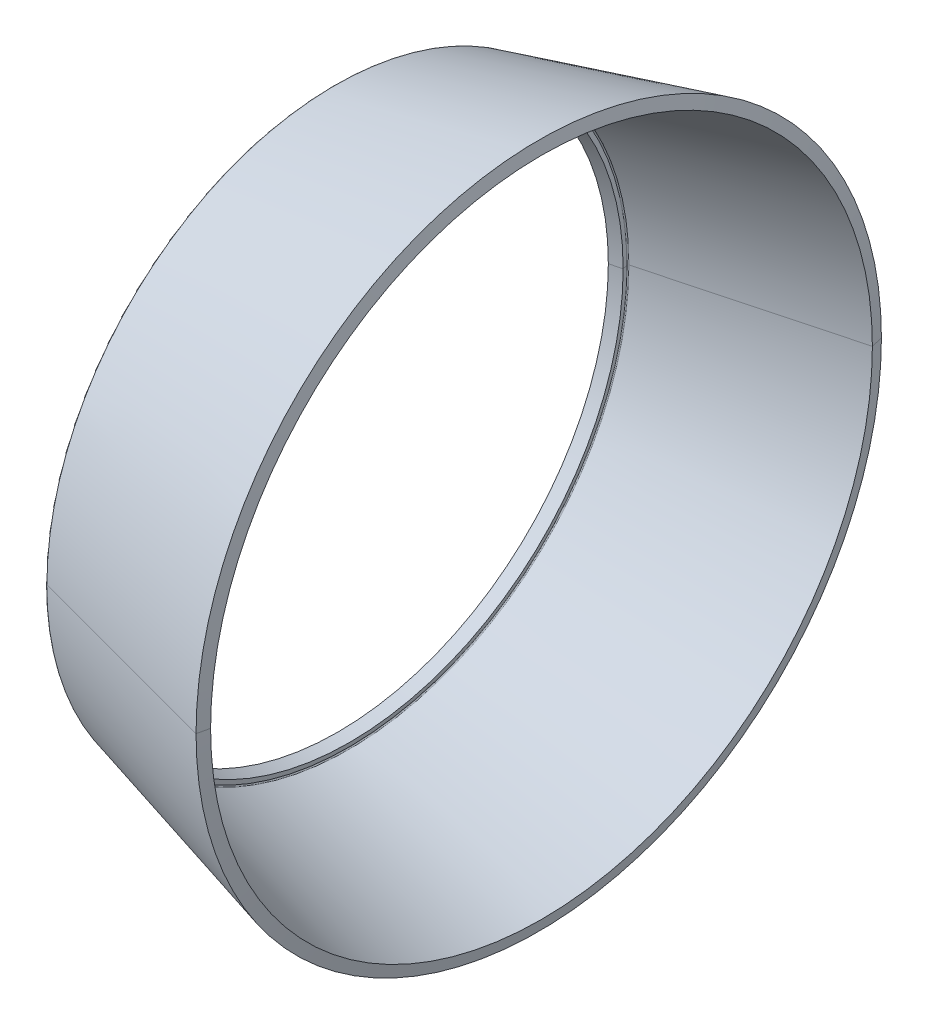
ISO-10303-21;
HEADER;
FILE_DESCRIPTION(('STEP AP214'),'2;1');
FILE_NAME('part.step','',(''),(''),'','','');
FILE_SCHEMA(('AUTOMOTIVE_DESIGN { 1 0 10303 214 1 1 1 1 }'));
ENDSEC;
DATA;
#1=APPLICATION_CONTEXT('core data for automotive mechanical design processes');
#2=APPLICATION_PROTOCOL_DEFINITION('international standard','automotive_design',2000,#1);
#3=PRODUCT_CONTEXT('',#1,'mechanical');
#4=PRODUCT('Part','Part','',(#3));
#5=PRODUCT_RELATED_PRODUCT_CATEGORY('part','',(#4));
#6=PRODUCT_DEFINITION_FORMATION('','',#4);
#7=PRODUCT_DEFINITION_CONTEXT('part definition',#1,'design');
#8=PRODUCT_DEFINITION('design','',#6,#7);
#9=PRODUCT_DEFINITION_SHAPE('','',#8);
#10=(LENGTH_UNIT() NAMED_UNIT(*) SI_UNIT(.MILLI.,.METRE.));
#11=(NAMED_UNIT(*) PLANE_ANGLE_UNIT() SI_UNIT($,.RADIAN.));
#12=(NAMED_UNIT(*) SI_UNIT($,.STERADIAN.) SOLID_ANGLE_UNIT());
#13=UNCERTAINTY_MEASURE_WITH_UNIT(LENGTH_MEASURE(1.E-05),#10,'distance_accuracy_value','');
#14=(GEOMETRIC_REPRESENTATION_CONTEXT(3) GLOBAL_UNCERTAINTY_ASSIGNED_CONTEXT((#13)) GLOBAL_UNIT_ASSIGNED_CONTEXT((#10,
#11,#12)) REPRESENTATION_CONTEXT('',''));
#15=CARTESIAN_POINT('',(0.,0.,0.));
#16=DIRECTION('',(0.,0.,1.));
#17=DIRECTION('',(1.,0.,0.));
#18=AXIS2_PLACEMENT_3D('',#15,#16,#17);
#19=CARTESIAN_POINT('',(15.054446933231,0.,0.));
#20=DIRECTION('',(1.,0.,0.));
#21=DIRECTION('',(0.,1.,0.));
#22=AXIS2_PLACEMENT_3D('',#19,#20,#21);
#23=CONICAL_SURFACE('',#22,28.295849956744,0.260638743846578);
#24=DIRECTION('',(0.966225572384578,0.,0.257697775058488));
#25=VECTOR('',#24,1.);
#26=CARTESIAN_POINT('',(-1.7409368670992,0.,23.816426972816));
#27=LINE('',#26,#25);
#28=CARTESIAN_POINT('',(-1.7409368670992,0.,23.816426972816));
#29=VERTEX_POINT('',#28);
#30=CARTESIAN_POINT('',(15.054446933231,0.,28.295849956744));
#31=VERTEX_POINT('',#30);
#32=EDGE_CURVE('E11',#29,#31,#27,.T.);
#33=ORIENTED_EDGE('',*,*,#32,.F.);
#34=CARTESIAN_POINT('',(-1.7409368670992,0.,0.));
#35=DIRECTION('',(1.,0.,0.));
#36=DIRECTION('',(0.,0.,-1.));
#37=AXIS2_PLACEMENT_3D('',#34,#35,#36);
#38=CIRCLE('',#37,23.816426972816);
#39=CARTESIAN_POINT('',(-1.74093686709921,-22.6507680673643,-7.35968067989002));
#40=VERTEX_POINT('',#39);
#41=EDGE_CURVE('E25',#29,#40,#38,.T.);
#42=ORIENTED_EDGE('',*,*,#41,.T.);
#43=CARTESIAN_POINT('',(-1.7409368670992,0.,0.));
#44=DIRECTION('',(1.,0.,0.));
#45=DIRECTION('',(0.,0.,-1.));
#46=AXIS2_PLACEMENT_3D('',#43,#44,#45);
#47=CIRCLE('',#46,23.816426972816);
#48=CARTESIAN_POINT('',(-1.7409368670992,0.,-23.816426972816));
#49=VERTEX_POINT('',#48);
#50=EDGE_CURVE('E385',#40,#49,#47,.T.);
#51=ORIENTED_EDGE('',*,*,#50,.T.);
#52=DIRECTION('',(0.966225572384578,0.,-0.257697775058488));
#53=VECTOR('',#52,1.);
#54=CARTESIAN_POINT('',(-1.7409368670992,0.,-23.816426972816));
#55=LINE('',#54,#53);
#56=CARTESIAN_POINT('',(15.054446933231,0.,-28.295849956744));
#57=VERTEX_POINT('',#56);
#58=EDGE_CURVE('E125',#49,#57,#55,.T.);
#59=ORIENTED_EDGE('',*,*,#58,.T.);
#60=CARTESIAN_POINT('',(15.054446933231,0.,0.));
#61=DIRECTION('',(1.,0.,0.));
#62=DIRECTION('',(0.,0.,-1.));
#63=AXIS2_PLACEMENT_3D('',#60,#61,#62);
#64=CIRCLE('',#63,28.295849956744);
#65=EDGE_CURVE('E377',#31,#57,#64,.T.);
#66=ORIENTED_EDGE('',*,*,#65,.F.);
#67=EDGE_LOOP('',(#33,#42,#51,#59,#66));
#68=FACE_BOUND('',#67,.T.);
#69=ADVANCED_FACE('F17',(#68),#23,.T.);
#70=CARTESIAN_POINT('',(15.282058371676,0.,0.));
#71=DIRECTION('',(-1.,0.,0.));
#72=DIRECTION('',(0.,1.,0.));
#73=AXIS2_PLACEMENT_3D('',#70,#71,#72);
#74=CONICAL_SURFACE('',#73,27.321600189775,1.34128553015771);
#75=DIRECTION('',(-0.227501175399713,0.,-0.973777805863201));
#76=VECTOR('',#75,1.);
#77=CARTESIAN_POINT('',(15.282058371676,0.,-27.321600189775));
#78=LINE('',#77,#76);
#79=CARTESIAN_POINT('',(15.282058371676,0.,-27.321600189775));
#80=VERTEX_POINT('',#79);
#81=EDGE_CURVE('E372',#80,#57,#78,.T.);
#82=ORIENTED_EDGE('',*,*,#81,.F.);
#83=CARTESIAN_POINT('',(15.282058371676,0.,0.));
#84=DIRECTION('',(1.,0.,0.));
#85=DIRECTION('',(0.,0.,-1.));
#86=AXIS2_PLACEMENT_3D('',#83,#84,#85);
#87=CIRCLE('',#86,27.321600189775);
#88=CARTESIAN_POINT('',(15.282058371676,0.,27.321600189775));
#89=VERTEX_POINT('',#88);
#90=EDGE_CURVE('E367',#89,#80,#87,.T.);
#91=ORIENTED_EDGE('',*,*,#90,.F.);
#92=DIRECTION('',(-0.227501175399713,0.,0.973777805863201));
#93=VECTOR('',#92,1.);
#94=CARTESIAN_POINT('',(15.282058371676,0.,27.321600189775));
#95=LINE('',#94,#93);
#96=EDGE_CURVE('E362',#89,#31,#95,.T.);
#97=ORIENTED_EDGE('',*,*,#96,.T.);
#98=ORIENTED_EDGE('',*,*,#65,.T.);
#99=EDGE_LOOP('',(#82,#91,#97,#98));
#100=FACE_BOUND('',#99,.T.);
#101=ADVANCED_FACE('F426',(#100),#74,.T.);
#102=CARTESIAN_POINT('',(15.282058371676,0.,0.));
#103=DIRECTION('',(-1.,0.,0.));
#104=DIRECTION('',(0.,-1.,0.));
#105=AXIS2_PLACEMENT_3D('',#102,#103,#104);
#106=CONICAL_SURFACE('',#105,27.321600189775,1.34128553015771);
#107=ORIENTED_EDGE('',*,*,#81,.T.);
#108=CARTESIAN_POINT('',(15.054446933231,0.,0.));
#109=DIRECTION('',(1.,0.,0.));
#110=DIRECTION('',(0.,0.,-1.));
#111=AXIS2_PLACEMENT_3D('',#108,#109,#110);
#112=CIRCLE('',#111,28.295849956744);
#113=EDGE_CURVE('E357',#57,#31,#112,.T.);
#114=ORIENTED_EDGE('',*,*,#113,.T.);
#115=ORIENTED_EDGE('',*,*,#96,.F.);
#116=CARTESIAN_POINT('',(15.282058371676,0.,0.));
#117=DIRECTION('',(1.,0.,0.));
#118=DIRECTION('',(0.,0.,-1.));
#119=AXIS2_PLACEMENT_3D('',#116,#117,#118);
#120=CIRCLE('',#119,27.321600189775);
#121=EDGE_CURVE('E352',#80,#89,#120,.T.);
#122=ORIENTED_EDGE('',*,*,#121,.F.);
#123=EDGE_LOOP('',(#107,#114,#115,#122));
#124=FACE_BOUND('',#123,.T.);
#125=ADVANCED_FACE('F430',(#124),#106,.T.);
#126=CARTESIAN_POINT('',(-0.587217882089972,0.,0.));
#127=DIRECTION('',(1.,0.,0.));
#128=DIRECTION('',(0.,-1.,0.));
#129=AXIS2_PLACEMENT_3D('',#126,#127,#128);
#130=CONICAL_SURFACE('',#129,23.089175278591,0.260638743846549);
#131=DIRECTION('',(0.966225572384585,0.,0.25769777505846));
#132=VECTOR('',#131,1.);
#133=CARTESIAN_POINT('',(-0.587217882089986,0.,23.089175278591));
#134=LINE('',#133,#132);
#135=CARTESIAN_POINT('',(-0.587217882089986,0.,23.089175278591));
#136=VERTEX_POINT('',#135);
#137=EDGE_CURVE('E340',#136,#89,#134,.T.);
#138=ORIENTED_EDGE('',*,*,#137,.F.);
#139=CARTESIAN_POINT('',(-0.587217882089972,0.,0.));
#140=DIRECTION('',(1.,0.,0.));
#141=DIRECTION('',(0.,0.,-1.));
#142=AXIS2_PLACEMENT_3D('',#139,#140,#141);
#143=CIRCLE('',#142,23.089175278591);
#144=CARTESIAN_POINT('',(-0.587217882089975,21.959110604585,7.13494754718653));
#145=VERTEX_POINT('',#144);
#146=EDGE_CURVE('E337',#145,#136,#143,.T.);
#147=ORIENTED_EDGE('',*,*,#146,.F.);
#148=CARTESIAN_POINT('',(-0.587217882089972,0.,0.));
#149=DIRECTION('',(1.,0.,0.));
#150=DIRECTION('',(0.,0.,-1.));
#151=AXIS2_PLACEMENT_3D('',#148,#149,#150);
#152=CIRCLE('',#151,23.089175278591);
#153=CARTESIAN_POINT('',(-0.587217882089972,0.,-23.089175278591));
#154=VERTEX_POINT('',#153);
#155=EDGE_CURVE('E330',#154,#145,#152,.T.);
#156=ORIENTED_EDGE('',*,*,#155,.F.);
#157=DIRECTION('',(0.966225572384585,0.,-0.25769777505846));
#158=VECTOR('',#157,1.);
#159=CARTESIAN_POINT('',(-0.587217882089986,0.,-23.089175278591));
#160=LINE('',#159,#158);
#161=EDGE_CURVE('E338',#154,#80,#160,.T.);
#162=ORIENTED_EDGE('',*,*,#161,.T.);
#163=ORIENTED_EDGE('',*,*,#121,.T.);
#164=EDGE_LOOP('',(#138,#147,#156,#162,#163));
#165=FACE_BOUND('',#164,.T.);
#166=ADVANCED_FACE('F435',(#165),#130,.F.);
#167=CARTESIAN_POINT('',(-0.587217882089972,0.,0.));
#168=DIRECTION('',(1.,0.,0.));
#169=DIRECTION('',(0.,1.,0.));
#170=AXIS2_PLACEMENT_3D('',#167,#168,#169);
#171=CONICAL_SURFACE('',#170,23.089175278591,0.260638743846549);
#172=ORIENTED_EDGE('',*,*,#137,.T.);
#173=ORIENTED_EDGE('',*,*,#90,.T.);
#174=ORIENTED_EDGE('',*,*,#161,.F.);
#175=CARTESIAN_POINT('',(-0.587217882089972,0.,0.));
#176=DIRECTION('',(1.,0.,0.));
#177=DIRECTION('',(0.,0.,-1.));
#178=AXIS2_PLACEMENT_3D('',#175,#176,#177);
#179=CIRCLE('',#178,23.089175278591);
#180=CARTESIAN_POINT('',(-0.587217882089975,-21.959110604585,-7.13494754718653));
#181=VERTEX_POINT('',#180);
#182=EDGE_CURVE('E333',#181,#154,#179,.T.);
#183=ORIENTED_EDGE('',*,*,#182,.F.);
#184=CARTESIAN_POINT('',(-0.587217882089972,0.,0.));
#185=DIRECTION('',(1.,0.,0.));
#186=DIRECTION('',(0.,0.,-1.));
#187=AXIS2_PLACEMENT_3D('',#184,#185,#186);
#188=CIRCLE('',#187,23.089175278591);
#189=EDGE_CURVE('E447',#136,#181,#188,.T.);
#190=ORIENTED_EDGE('',*,*,#189,.F.);
#191=EDGE_LOOP('',(#172,#173,#174,#183,#190));
#192=FACE_BOUND('',#191,.T.);
#193=ADVANCED_FACE('F301',(#192),#171,.F.);
#194=CARTESIAN_POINT('',(-0.564884074918387,0.,0.));
#195=DIRECTION('',(1.,0.,0.));
#196=DIRECTION('',(0.,0.309016994374947,-0.951056516295154));
#197=AXIS2_PLACEMENT_3D('',#194,#195,#196);
#198=TOROIDAL_SURFACE('',#197,23.0054357289845,0.0866666666664838);
#199=CARTESIAN_POINT('',(-0.564884074918387,-21.8794695602601,-7.10907060325681));
#200=DIRECTION('',(0.,0.309016994374945,-0.951056516295154));
#201=DIRECTION('',(-0.257697775057337,-0.91893512682766,-0.298580122266588));
#202=AXIS2_PLACEMENT_3D('',#199,#200,#201);
#203=CIRCLE('',#202,0.0866666666664824);
#204=CARTESIAN_POINT('',(-0.649278151426377,-21.860717799065,-7.1029777867055));
#205=VERTEX_POINT('',#204);
#206=EDGE_CURVE('E448',#181,#205,#203,.T.);
#207=ORIENTED_EDGE('',*,*,#206,.T.);
#208=CARTESIAN_POINT('',(-0.649278151426381,0.,0.));
#209=DIRECTION('',(1.,0.,0.));
#210=DIRECTION('',(0.,0.,1.));
#211=AXIS2_PLACEMENT_3D('',#208,#209,#210);
#212=CIRCLE('',#211,22.98571896045);
#213=CARTESIAN_POINT('',(-0.649278151426381,0.,22.98571896045));
#214=VERTEX_POINT('',#213);
#215=EDGE_CURVE('E267',#214,#205,#212,.T.);
#216=ORIENTED_EDGE('',*,*,#215,.F.);
#217=CARTESIAN_POINT('',(-0.649278151426381,0.,0.));
#218=DIRECTION('',(1.,0.,0.));
#219=DIRECTION('',(0.,0.951056516295156,0.309016994374939));
#220=AXIS2_PLACEMENT_3D('',#217,#218,#219);
#221=CIRCLE('',#220,22.98571896045);
#222=CARTESIAN_POINT('',(-0.649278151426377,21.860717799065,7.1029777867055));
#223=VERTEX_POINT('',#222);
#224=EDGE_CURVE('E242',#223,#214,#221,.T.);
#225=ORIENTED_EDGE('',*,*,#224,.F.);
#226=CARTESIAN_POINT('',(-0.564884074918387,21.8794695602601,7.10907060325682));
#227=DIRECTION('',(0.,-0.309016994374946,0.951056516295154));
#228=DIRECTION('',(-0.257697775057336,0.91893512682766,0.298580122266588));
#229=AXIS2_PLACEMENT_3D('',#226,#227,#228);
#230=CIRCLE('',#229,0.0866666666664823);
#231=EDGE_CURVE('E324',#145,#223,#230,.T.);
#232=ORIENTED_EDGE('',*,*,#231,.F.);
#233=ORIENTED_EDGE('',*,*,#146,.T.);
#234=ORIENTED_EDGE('',*,*,#189,.T.);
#235=EDGE_LOOP('',(#207,#216,#225,#232,#233,#234));
#236=FACE_BOUND('',#235,.T.);
#237=ADVANCED_FACE('F296',(#236),#198,.F.);
#238=CARTESIAN_POINT('',(-0.564884074918387,0.,0.));
#239=DIRECTION('',(1.,0.,0.));
#240=DIRECTION('',(0.,-0.309016994374947,0.951056516295154));
#241=AXIS2_PLACEMENT_3D('',#238,#239,#240);
#242=TOROIDAL_SURFACE('',#241,23.0054357289845,0.0866666666664838);
#243=ORIENTED_EDGE('',*,*,#206,.F.);
#244=ORIENTED_EDGE('',*,*,#182,.T.);
#245=ORIENTED_EDGE('',*,*,#155,.T.);
#246=ORIENTED_EDGE('',*,*,#231,.T.);
#247=CARTESIAN_POINT('',(-0.649278151426382,0.,0.));
#248=DIRECTION('',(1.,0.,0.));
#249=DIRECTION('',(0.,0.,-1.));
#250=AXIS2_PLACEMENT_3D('',#247,#248,#249);
#251=CIRCLE('',#250,22.98571896045);
#252=CARTESIAN_POINT('',(-0.649278151426382,0.,-22.98571896045));
#253=VERTEX_POINT('',#252);
#254=EDGE_CURVE('E326',#253,#223,#251,.T.);
#255=ORIENTED_EDGE('',*,*,#254,.F.);
#256=CARTESIAN_POINT('',(-0.649278151426381,0.,0.));
#257=DIRECTION('',(1.,0.,0.));
#258=DIRECTION('',(0.,-0.951056516295153,-0.30901699437495));
#259=AXIS2_PLACEMENT_3D('',#256,#257,#258);
#260=CIRCLE('',#259,22.98571896045);
#261=EDGE_CURVE('E256',#205,#253,#260,.T.);
#262=ORIENTED_EDGE('',*,*,#261,.F.);
#263=EDGE_LOOP('',(#243,#244,#245,#246,#255,#262));
#264=FACE_BOUND('',#263,.T.);
#265=ADVANCED_FACE('F287',(#264),#242,.F.);
#266=CARTESIAN_POINT('',(-0.554584816033737,0.,0.));
#267=DIRECTION('',(-1.,0.,0.));
#268=DIRECTION('',(0.,1.,0.));
#269=AXIS2_PLACEMENT_3D('',#266,#267,#268);
#270=CONICAL_SURFACE('',#269,22.580401193601,1.34128553015775);
#271=DIRECTION('',(-0.227501175399673,0.,-0.97377780586321));
#272=VECTOR('',#271,1.);
#273=CARTESIAN_POINT('',(-0.554584816033737,0.,-22.580401193601));
#274=LINE('',#273,#272);
#275=CARTESIAN_POINT('',(-0.554584816033737,0.,-22.580401193601));
#276=VERTEX_POINT('',#275);
#277=EDGE_CURVE('E276',#276,#253,#274,.T.);
#278=ORIENTED_EDGE('',*,*,#277,.F.);
#279=CARTESIAN_POINT('',(-0.554584816033737,0.,0.));
#280=DIRECTION('',(1.,0.,0.));
#281=DIRECTION('',(0.,0.,-1.));
#282=AXIS2_PLACEMENT_3D('',#279,#280,#281);
#283=CIRCLE('',#282,22.580401193601);
#284=CARTESIAN_POINT('',(-0.554584816033737,0.,22.580401193601));
#285=VERTEX_POINT('',#284);
#286=EDGE_CURVE('E270',#285,#276,#283,.T.);
#287=ORIENTED_EDGE('',*,*,#286,.F.);
#288=DIRECTION('',(-0.227501175399673,0.,0.97377780586321));
#289=VECTOR('',#288,1.);
#290=CARTESIAN_POINT('',(-0.554584816033737,0.,22.580401193601));
#291=LINE('',#290,#289);
#292=EDGE_CURVE('E268',#285,#214,#291,.T.);
#293=ORIENTED_EDGE('',*,*,#292,.T.);
#294=ORIENTED_EDGE('',*,*,#215,.T.);
#295=ORIENTED_EDGE('',*,*,#261,.T.);
#296=EDGE_LOOP('',(#278,#287,#293,#294,#295));
#297=FACE_BOUND('',#296,.T.);
#298=ADVANCED_FACE('F222',(#297),#270,.T.);
#299=CARTESIAN_POINT('',(-0.554584816033737,0.,0.));
#300=DIRECTION('',(-1.,0.,0.));
#301=DIRECTION('',(0.,-1.,0.));
#302=AXIS2_PLACEMENT_3D('',#299,#300,#301);
#303=CONICAL_SURFACE('',#302,22.580401193601,1.34128553015775);
#304=ORIENTED_EDGE('',*,*,#277,.T.);
#305=ORIENTED_EDGE('',*,*,#254,.T.);
#306=ORIENTED_EDGE('',*,*,#224,.T.);
#307=ORIENTED_EDGE('',*,*,#292,.F.);
#308=CARTESIAN_POINT('',(-0.554584816033737,0.,0.));
#309=DIRECTION('',(1.,0.,0.));
#310=DIRECTION('',(0.,0.,-1.));
#311=AXIS2_PLACEMENT_3D('',#308,#309,#310);
#312=CIRCLE('',#311,22.580401193601);
#313=EDGE_CURVE('E271',#276,#285,#312,.T.);
#314=ORIENTED_EDGE('',*,*,#313,.F.);
#315=EDGE_LOOP('',(#304,#305,#306,#307,#314));
#316=FACE_BOUND('',#315,.T.);
#317=ADVANCED_FACE('F217',(#316),#303,.T.);
#318=CARTESIAN_POINT('',(-1.5212786891811,0.,0.));
#319=DIRECTION('',(1.,0.,0.));
#320=DIRECTION('',(0.,-1.,0.));
#321=AXIS2_PLACEMENT_3D('',#318,#319,#320);
#322=CONICAL_SURFACE('',#321,22.322578520104,0.26063874384719);
#323=DIRECTION('',(0.96622557238442,0.,0.25769777505908));
#324=VECTOR('',#323,1.);
#325=CARTESIAN_POINT('',(-1.52127868918109,0.,22.322578520104));
#326=LINE('',#325,#324);
#327=CARTESIAN_POINT('',(-1.5212786891811,0.,22.322578520104));
#328=VERTEX_POINT('',#327);
#329=EDGE_CURVE('E413',#328,#285,#326,.T.);
#330=ORIENTED_EDGE('',*,*,#329,.F.);
#331=CARTESIAN_POINT('',(-1.5212786891811,0.,0.));
#332=DIRECTION('',(1.,0.,0.));
#333=DIRECTION('',(0.,0.,-1.));
#334=AXIS2_PLACEMENT_3D('',#331,#332,#333);
#335=CIRCLE('',#334,22.322578520104);
#336=CARTESIAN_POINT('',(-1.5212786891811,0.,-22.322578520104));
#337=VERTEX_POINT('',#336);
#338=EDGE_CURVE('E408',#337,#328,#335,.T.);
#339=ORIENTED_EDGE('',*,*,#338,.F.);
#340=DIRECTION('',(0.96622557238442,0.,-0.25769777505908));
#341=VECTOR('',#340,1.);
#342=CARTESIAN_POINT('',(-1.52127868918109,0.,-22.322578520104));
#343=LINE('',#342,#341);
#344=EDGE_CURVE('E399',#337,#276,#343,.T.);
#345=ORIENTED_EDGE('',*,*,#344,.T.);
#346=ORIENTED_EDGE('',*,*,#313,.T.);
#347=EDGE_LOOP('',(#330,#339,#345,#346));
#348=FACE_BOUND('',#347,.T.);
#349=ADVANCED_FACE('F213',(#348),#322,.F.);
#350=CARTESIAN_POINT('',(-1.5212786891811,0.,0.));
#351=DIRECTION('',(1.,0.,0.));
#352=DIRECTION('',(0.,1.,0.));
#353=AXIS2_PLACEMENT_3D('',#350,#351,#352);
#354=CONICAL_SURFACE('',#353,22.322578520104,0.26063874384719);
#355=ORIENTED_EDGE('',*,*,#329,.T.);
#356=ORIENTED_EDGE('',*,*,#286,.T.);
#357=ORIENTED_EDGE('',*,*,#344,.F.);
#358=CARTESIAN_POINT('',(-1.5212786891811,0.,0.));
#359=DIRECTION('',(1.,0.,0.));
#360=DIRECTION('',(0.,0.,-1.));
#361=AXIS2_PLACEMENT_3D('',#358,#359,#360);
#362=CIRCLE('',#361,22.322578520104);
#363=EDGE_CURVE('E398',#328,#337,#362,.T.);
#364=ORIENTED_EDGE('',*,*,#363,.F.);
#365=EDGE_LOOP('',(#355,#356,#357,#364));
#366=FACE_BOUND('',#365,.T.);
#367=ADVANCED_FACE('F209',(#366),#354,.F.);
#368=CARTESIAN_POINT('',(-1.8340272711038,0.,0.));
#369=DIRECTION('',(-1.,0.,0.));
#370=DIRECTION('',(0.,1.,0.));
#371=AXIS2_PLACEMENT_3D('',#368,#369,#370);
#372=CONICAL_SURFACE('',#371,23.661242495604,1.3412855301577);
#373=DIRECTION('',(-0.227501175399721,0.,-0.973777805863199));
#374=VECTOR('',#373,1.);
#375=CARTESIAN_POINT('',(-1.5212786891811,0.,-22.322578520104));
#376=LINE('',#375,#374);
#377=CARTESIAN_POINT('',(-1.8340272711038,0.,-23.661242495604));
#378=VERTEX_POINT('',#377);
#379=EDGE_CURVE('E397',#337,#378,#376,.T.);
#380=ORIENTED_EDGE('',*,*,#379,.T.);
#381=CARTESIAN_POINT('',(-1.8340272711038,-22.503178859084,-7.31172603916831));
#382=CARTESIAN_POINT('',(-1.8340272711038,-22.4074717500598,-7.60629312341181));
#383=CARTESIAN_POINT('',(-1.8340272711038,-22.3059746365077,-7.89897868033875));
#384=CARTESIAN_POINT('',(-1.8340272711038,-22.0915707765655,-8.48014055841196));
#385=CARTESIAN_POINT('',(-1.8340272711038,-21.9786640301753,-8.76861687955824));
#386=CARTESIAN_POINT('',(-1.8340272711038,-21.7416112807744,-9.34091410492264));
#387=CARTESIAN_POINT('',(-1.8340272711038,-21.6174652777636,-9.62473500914076));
#388=CARTESIAN_POINT('',(-1.8340272711038,-21.3581264354418,-10.1872841368972));
#389=CARTESIAN_POINT('',(-1.8340272711038,-21.2229335961308,-10.4660123604356));
#390=CARTESIAN_POINT('',(-1.8340272711038,-20.9417092718416,-11.0179462496401));
#391=CARTESIAN_POINT('',(-1.8340272711038,-20.7956777868635,-11.2911519153063));
#392=CARTESIAN_POINT('',(-1.8340272711038,-20.4930014127279,-11.8316194518187));
#393=CARTESIAN_POINT('',(-1.8340272711038,-20.3363565235705,-12.0988813226648));
#394=CARTESIAN_POINT('',(-1.8340272711038,-20.0126948569772,-12.6270491640334));
#395=CARTESIAN_POINT('',(-1.8340272711038,-19.8456780795413,-12.8879551345559));
#396=CARTESIAN_POINT('',(-1.8340272711038,-19.5015301692914,-13.4030088790761));
#397=CARTESIAN_POINT('',(-1.8340272711038,-19.3243990364774,-13.6571566530738));
#398=CARTESIAN_POINT('',(-1.8340272711038,-18.9602955374633,-14.1583021265901));
#399=CARTESIAN_POINT('',(-1.8340272711038,-18.7733231712632,-14.4052998261089));
#400=CARTESIAN_POINT('',(-1.8340272711038,-18.3898255036824,-14.8917642982534));
#401=CARTESIAN_POINT('',(-1.8340272711038,-18.1933002023016,-15.1312310708792));
#402=CARTESIAN_POINT('',(-1.8340272711038,-17.7909996920309,-15.6022644487951));
#403=CARTESIAN_POINT('',(-1.8340272711038,-17.585224483141,-15.8338310540852));
#404=CARTESIAN_POINT('',(-1.8340272711038,-17.1647414483355,-16.2887070384182));
#405=CARTESIAN_POINT('',(-1.8340272711038,-16.9500336224201,-16.5120164174611));
#406=CARTESIAN_POINT('',(-1.8340272711038,-16.5120164174618,-16.9500336224206));
#407=CARTESIAN_POINT('',(-1.8340272711038,-16.288707038419,-17.1647414483371));
#408=CARTESIAN_POINT('',(-1.8340272711038,-15.8338310540845,-17.5852244831392));
#409=CARTESIAN_POINT('',(-1.8340272711038,-15.602264448793,-17.7909996920248));
#410=CARTESIAN_POINT('',(-1.8340272711038,-15.1312310708816,-18.1933002023076));
#411=CARTESIAN_POINT('',(-1.8340272711038,-14.8917642982618,-18.3898255037048));
#412=CARTESIAN_POINT('',(-1.8340272711038,-14.4052998261006,-18.7733231712407));
#413=CARTESIAN_POINT('',(-1.8340272711038,-14.1583021265592,-18.9602955373793));
#414=CARTESIAN_POINT('',(-1.8340272711038,-13.6571566531048,-19.3243990365613));
#415=CARTESIAN_POINT('',(-1.8340272711038,-13.4030088791918,-19.5015301696047));
#416=CARTESIAN_POINT('',(-1.8340272711038,-12.8879551344404,-19.8456780792279));
#417=CARTESIAN_POINT('',(-1.8340272711038,-12.6270491636021,-20.0126948558078));
#418=CARTESIAN_POINT('',(-1.8340272711038,-12.0988813230963,-20.3363565247398));
#419=CARTESIAN_POINT('',(-1.8340272711038,-11.8316194534288,-20.493001417092));
#420=CARTESIAN_POINT('',(-1.8340272711038,-11.2911519136964,-20.7956777824993));
#421=CARTESIAN_POINT('',(-1.8340272711038,-11.0179462436313,-20.9417092555543));
#422=CARTESIAN_POINT('',(-1.8340272711038,-10.4660123664445,-21.2229336124181));
#423=CARTESIAN_POINT('',(-1.8340272711038,-10.1872841593227,-21.358126496227));
#424=CARTESIAN_POINT('',(-1.8340272711038,-9.62473498671542,-21.6174652169783));
#425=CARTESIAN_POINT('',(-1.8340272711038,-9.34091402122992,-21.7416110539208));
#426=CARTESIAN_POINT('',(-1.8340272711038,-8.76861696325113,-21.9786642570288));
#427=CARTESIAN_POINT('',(-1.8340272711038,-8.48014087075783,-22.0915716231943));
#428=CARTESIAN_POINT('',(-1.8340272711038,-7.89897836799305,-22.3059737898788));
#429=CARTESIAN_POINT('',(-1.8340272711038,-7.60629195772156,-22.4074685903977));
#430=CARTESIAN_POINT('',(-1.8340272711038,-7.01716012061524,-22.5988891277703));
#431=CARTESIAN_POINT('',(-1.8340272711038,-6.72071469378043,-22.6888148646239));
#432=CARTESIAN_POINT('',(-1.8340272711038,-6.12452192096644,-22.8569586171633));
#433=CARTESIAN_POINT('',(-1.8340272711038,-5.82477457498727,-22.9351766328489));
#434=CARTESIAN_POINT('',(-1.8340272711038,-5.22244015235107,-23.0797843310722));
#435=CARTESIAN_POINT('',(-1.8340272711038,-4.91985307569403,-23.1461740136098));
#436=CARTESIAN_POINT('',(-1.8340272711038,-4.31230575984431,-23.2670226978698));
#437=CARTESIAN_POINT('',(-1.8340272711038,-4.00734552065162,-23.3214816995921));
#438=CARTESIAN_POINT('',(-1.8340272711038,-3.39552210332252,-23.4183849742124));
#439=CARTESIAN_POINT('',(-1.8340272711038,-3.08865892518611,-23.4608292471103));
#440=CARTESIAN_POINT('',(-1.8340272711038,-2.47350280191822,-23.5336379023813));
#441=CARTESIAN_POINT('',(-1.8340272711038,-2.16520985678675,-23.5640022847544));
#442=CARTESIAN_POINT('',(-1.8340272711038,-1.54766952321811,-23.6126032783066));
#443=CARTESIAN_POINT('',(-1.8340272711038,-1.23842213478094,-23.6308398894857));
#444=CARTESIAN_POINT('',(-1.8340272711038,-0.619449907235353,-23.6551611807951));
#445=CARTESIAN_POINT('',(-1.8340272711038,-0.309725068126928,-23.6612458609254));
#446=CARTESIAN_POINT('',(-1.8340272711038,0.,-23.661242495604));
#447=B_SPLINE_CURVE_WITH_KNOTS('',3,(#381,#382,#383,#384,#385,#386,#387,#388,#389,#390,#391,
#392,#393,#394,#395,#396,#397,#398,#399,#400,#401,#402,#403,#404,#405,#406,#407,#408,#409,#410,
#411,#412,#413,#414,#415,#416,#417,#418,#419,#420,#421,#422,#423,#424,#425,#426,#427,#428,#429,
#430,#431,#432,#433,#434,#435,#436,#437,#438,#439,#440,#441,#442,#443,#444,#445,#446),
.UNSPECIFIED.,.F.,.F.,(4,2,2,2,2,2,2,2,2,2,2,2,2,2,2,2,2,2,2,2,2,2,2,2,2,2,2,2,2,2,2,2,4),(0.,
0.929115116790071,1.85823023358015,2.78734535037023,3.7164604671603,4.64557558395037,
5.57469070074044,6.50380581753052,7.43292093432059,8.36203605111067,9.29115116790075,
10.2202662846908,11.1493814014809,12.078496518271,13.007611635061,13.9367267518511,
14.8658418686412,15.7949569854313,16.7240721022213,17.6531872190114,18.5823023358015,
19.5114174525916,20.4405325693816,21.3696476861717,22.2987628029618,23.2278779197519,
24.1569930365419,25.086108153332,26.0152232701221,26.9443383869122,27.8734535037022,
28.8025686204923,29.7316837372824),.UNSPECIFIED.);
#448=CARTESIAN_POINT('',(-1.8340272711038,-22.503178859084,-7.31172603916832));
#449=VERTEX_POINT('',#448);
#450=EDGE_CURVE('E161',#449,#378,#447,.T.);
#451=ORIENTED_EDGE('',*,*,#450,.F.);
#452=CARTESIAN_POINT('',(-1.8340272711038,0.,0.));
#453=DIRECTION('',(1.,0.,0.));
#454=DIRECTION('',(0.,0.,-1.));
#455=AXIS2_PLACEMENT_3D('',#452,#453,#454);
#456=CIRCLE('',#455,23.661242495604);
#457=CARTESIAN_POINT('',(-1.8340272711038,0.,23.661242495604));
#458=VERTEX_POINT('',#457);
#459=EDGE_CURVE('E189',#458,#449,#456,.T.);
#460=ORIENTED_EDGE('',*,*,#459,.F.);
#461=DIRECTION('',(-0.227501175399721,0.,0.973777805863199));
#462=VECTOR('',#461,1.);
#463=CARTESIAN_POINT('',(-1.5212786891811,0.,22.322578520104));
#464=LINE('',#463,#462);
#465=EDGE_CURVE('E187',#328,#458,#464,.T.);
#466=ORIENTED_EDGE('',*,*,#465,.F.);
#467=ORIENTED_EDGE('',*,*,#363,.T.);
#468=EDGE_LOOP('',(#380,#451,#460,#466,#467));
#469=FACE_BOUND('',#468,.T.);
#470=ADVANCED_FACE('F200',(#469),#372,.F.);
#471=CARTESIAN_POINT('',(-1.8340272711038,0.,0.));
#472=DIRECTION('',(-1.,0.,0.));
#473=DIRECTION('',(0.,-1.,0.));
#474=AXIS2_PLACEMENT_3D('',#471,#472,#473);
#475=CONICAL_SURFACE('',#474,23.661242495604,1.3412855301577);
#476=ORIENTED_EDGE('',*,*,#379,.F.);
#477=ORIENTED_EDGE('',*,*,#338,.T.);
#478=ORIENTED_EDGE('',*,*,#465,.T.);
#479=CARTESIAN_POINT('',(-1.8340272711038,22.503178859084,7.31172603916833));
#480=CARTESIAN_POINT('',(-1.8340272711038,22.4074717500597,7.60629312341183));
#481=CARTESIAN_POINT('',(-1.8340272711038,22.3059746365077,7.89897868033876));
#482=CARTESIAN_POINT('',(-1.8340272711038,22.0915707765655,8.48014055841198));
#483=CARTESIAN_POINT('',(-1.8340272711038,21.9786640301753,8.76861687955826));
#484=CARTESIAN_POINT('',(-1.8340272711038,21.7416112807744,9.34091410492266));
#485=CARTESIAN_POINT('',(-1.8340272711038,21.6174652777636,9.62473500914078));
#486=CARTESIAN_POINT('',(-1.8340272711038,21.3581264354418,10.1872841368972));
#487=CARTESIAN_POINT('',(-1.8340272711038,21.2229335961308,10.4660123604356));
#488=CARTESIAN_POINT('',(-1.8340272711038,20.9417092718416,11.0179462496401));
#489=CARTESIAN_POINT('',(-1.8340272711038,20.7956777868635,11.2911519153064));
#490=CARTESIAN_POINT('',(-1.8340272711038,20.4930014127279,11.8316194518187));
#491=CARTESIAN_POINT('',(-1.8340272711038,20.3363565235705,12.0988813226648));
#492=CARTESIAN_POINT('',(-1.8340272711038,20.0126948569772,12.6270491640334));
#493=CARTESIAN_POINT('',(-1.8340272711038,19.8456780795413,12.8879551345559));
#494=CARTESIAN_POINT('',(-1.8340272711038,19.5015301692914,13.4030088790761));
#495=CARTESIAN_POINT('',(-1.8340272711038,19.3243990364774,13.6571566530738));
#496=CARTESIAN_POINT('',(-1.8340272711038,18.9602955374633,14.1583021265902));
#497=CARTESIAN_POINT('',(-1.8340272711038,18.7733231712632,14.4052998261089));
#498=CARTESIAN_POINT('',(-1.8340272711038,18.3898255036824,14.8917642982534));
#499=CARTESIAN_POINT('',(-1.8340272711038,18.1933002023016,15.1312310708793));
#500=CARTESIAN_POINT('',(-1.8340272711038,17.7909996920309,15.6022644487952));
#501=CARTESIAN_POINT('',(-1.8340272711038,17.5852244831409,15.8338310540852));
#502=CARTESIAN_POINT('',(-1.8340272711038,17.1647414483355,16.2887070384182));
#503=CARTESIAN_POINT('',(-1.8340272711038,16.95003362242,16.5120164174612));
#504=CARTESIAN_POINT('',(-1.8340272711038,16.5120164174618,16.9500336224206));
#505=CARTESIAN_POINT('',(-1.8340272711038,16.2887070384189,17.1647414483372));
#506=CARTESIAN_POINT('',(-1.8340272711038,15.8338310540845,17.5852244831393));
#507=CARTESIAN_POINT('',(-1.8340272711038,15.6022644487929,17.7909996920248));
#508=CARTESIAN_POINT('',(-1.8340272711038,15.1312310708815,18.1933002023077));
#509=CARTESIAN_POINT('',(-1.8340272711038,14.8917642982617,18.3898255037049));
#510=CARTESIAN_POINT('',(-1.8340272711038,14.4052998261006,18.7733231712407));
#511=CARTESIAN_POINT('',(-1.8340272711038,14.1583021265592,18.9602955373793));
#512=CARTESIAN_POINT('',(-1.8340272711038,13.6571566531048,19.3243990365613));
#513=CARTESIAN_POINT('',(-1.8340272711038,13.4030088791917,19.5015301696047));
#514=CARTESIAN_POINT('',(-1.8340272711038,12.8879551344403,19.845678079228));
#515=CARTESIAN_POINT('',(-1.8340272711038,12.627049163602,20.0126948558078));
#516=CARTESIAN_POINT('',(-1.8340272711038,12.0988813230962,20.3363565247398));
#517=CARTESIAN_POINT('',(-1.8340272711038,11.8316194534288,20.4930014170921));
#518=CARTESIAN_POINT('',(-1.8340272711038,11.2911519136963,20.7956777824993));
#519=CARTESIAN_POINT('',(-1.8340272711038,11.0179462436313,20.9417092555543));
#520=CARTESIAN_POINT('',(-1.8340272711038,10.4660123664445,21.2229336124182));
#521=CARTESIAN_POINT('',(-1.8340272711038,10.1872841593227,21.358126496227));
#522=CARTESIAN_POINT('',(-1.8340272711038,9.62473498671536,21.6174652169784));
#523=CARTESIAN_POINT('',(-1.8340272711038,9.34091402122986,21.7416110539208));
#524=CARTESIAN_POINT('',(-1.8340272711038,8.76861696325107,21.9786642570288));
#525=CARTESIAN_POINT('',(-1.8340272711038,8.48014087075777,22.0915716231943));
#526=CARTESIAN_POINT('',(-1.8340272711038,7.89897836799298,22.3059737898788));
#527=CARTESIAN_POINT('',(-1.8340272711038,7.60629195772149,22.4074685903977));
#528=CARTESIAN_POINT('',(-1.8340272711038,7.01716012061518,22.5988891277703));
#529=CARTESIAN_POINT('',(-1.8340272711038,6.72071469378036,22.688814864624));
#530=CARTESIAN_POINT('',(-1.8340272711038,6.12452192096637,22.8569586171633));
#531=CARTESIAN_POINT('',(-1.8340272711038,5.8247745749872,22.935176632849));
#532=CARTESIAN_POINT('',(-1.8340272711038,5.22244015235098,23.0797843310722));
#533=CARTESIAN_POINT('',(-1.8340272711038,4.91985307569394,23.1461740136098));
#534=CARTESIAN_POINT('',(-1.8340272711038,4.31230575984422,23.2670226978698));
#535=CARTESIAN_POINT('',(-1.8340272711038,4.00734552065154,23.3214816995921));
#536=CARTESIAN_POINT('',(-1.8340272711038,3.39552210332245,23.4183849742124));
#537=CARTESIAN_POINT('',(-1.8340272711038,3.08865892518604,23.4608292471103));
#538=CARTESIAN_POINT('',(-1.8340272711038,2.47350280191815,23.5336379023813));
#539=CARTESIAN_POINT('',(-1.8340272711038,2.16520985678668,23.5640022847544));
#540=CARTESIAN_POINT('',(-1.8340272711038,1.54766952321803,23.6126032783066));
#541=CARTESIAN_POINT('',(-1.8340272711038,1.23842213478086,23.6308398894857));
#542=CARTESIAN_POINT('',(-1.8340272711038,0.619449907235267,23.6551611807951));
#543=CARTESIAN_POINT('',(-1.8340272711038,0.309725068126839,23.6612458609254));
#544=CARTESIAN_POINT('',(-1.8340272711038,0.,23.661242495604));
#545=B_SPLINE_CURVE_WITH_KNOTS('',3,(#479,#480,#481,#482,#483,#484,#485,#486,#487,#488,#489,
#490,#491,#492,#493,#494,#495,#496,#497,#498,#499,#500,#501,#502,#503,#504,#505,#506,#507,#508,
#509,#510,#511,#512,#513,#514,#515,#516,#517,#518,#519,#520,#521,#522,#523,#524,#525,#526,#527,
#528,#529,#530,#531,#532,#533,#534,#535,#536,#537,#538,#539,#540,#541,#542,#543,#544),
.UNSPECIFIED.,.F.,.F.,(4,2,2,2,2,2,2,2,2,2,2,2,2,2,2,2,2,2,2,2,2,2,2,2,2,2,2,2,2,2,2,2,4),(0.,
0.929115116790078,1.85823023358015,2.78734535037023,3.71646046716031,4.64557558395038,
5.57469070074046,6.50380581753054,7.43292093432061,8.36203605111069,9.29115116790077,
10.2202662846908,11.1493814014809,12.078496518271,13.0076116350611,13.9367267518511,
14.8658418686412,15.7949569854313,16.7240721022214,17.6531872190114,18.5823023358015,
19.5114174525916,20.4405325693817,21.3696476861718,22.2987628029618,23.2278779197519,
24.156993036542,25.0861081533321,26.0152232701221,26.9443383869122,27.8734535037023,
28.8025686204924,29.7316837372824),.UNSPECIFIED.);
#546=CARTESIAN_POINT('',(-1.8340272711038,22.503178859084,7.31172603916833));
#547=VERTEX_POINT('',#546);
#548=EDGE_CURVE('E186',#547,#458,#545,.T.);
#549=ORIENTED_EDGE('',*,*,#548,.F.);
#550=CARTESIAN_POINT('',(-1.8340272711038,0.,-23.661242495604));
#551=CARTESIAN_POINT('',(-1.8340272711038,0.464588382658867,-23.6612595161171));
#552=CARTESIAN_POINT('',(-1.8340272711038,0.929175026767991,-23.6475598705978));
#553=CARTESIAN_POINT('',(-1.8340272711038,1.85673769543568,-23.5928494846075));
#554=CARTESIAN_POINT('',(-1.8340272711038,2.31971371999425,-23.5518387441364));
#555=CARTESIAN_POINT('',(-1.8340272711038,3.24244800710984,-23.4426284053552));
#556=CARTESIAN_POINT('',(-1.8340272711038,3.70220626966686,-23.3744288070451));
#557=CARTESIAN_POINT('',(-1.8340272711038,4.61691054903677,-23.2110826863352));
#558=CARTESIAN_POINT('',(-1.8340272711038,5.07185656584965,-23.1159361639354));
#559=CARTESIAN_POINT('',(-1.8340272711038,5.97535816148846,-22.8990247999858));
#560=CARTESIAN_POINT('',(-1.8340272711038,6.4239137403144,-22.777259958436));
#561=CARTESIAN_POINT('',(-1.8340272711038,7.31307854223748,-22.507534716733));
#562=CARTESIAN_POINT('',(-1.8340272711038,7.75368776533462,-22.3595743165799));
#563=CARTESIAN_POINT('',(-1.8340272711038,8.62543147341603,-22.0379710964933));
#564=CARTESIAN_POINT('',(-1.8340272711038,9.0565659584003,-21.8643282765598));
#565=CARTESIAN_POINT('',(-1.8340272711038,9.90786468136713,-21.4919625732414));
#566=CARTESIAN_POINT('',(-1.8340272711038,10.3280289193497,-21.2932396898565));
#567=CARTESIAN_POINT('',(-1.8340272711038,11.155929690726,-20.871403178116));
#568=CARTESIAN_POINT('',(-1.8340272711038,11.5636662241197,-20.6482895497603));
#569=CARTESIAN_POINT('',(-1.8340272711038,12.3652972382536,-20.1784454820729));
#570=CARTESIAN_POINT('',(-1.8340272711038,12.7591917189939,-19.9317150427411));
#571=CARTESIAN_POINT('',(-1.8340272711038,13.5317722946381,-19.4154932060917));
#572=CARTESIAN_POINT('',(-1.8340272711038,13.9104583895422,-19.1460018087741));
#573=CARTESIAN_POINT('',(-1.8340272711038,14.6513086149101,-18.5851928625651));
#574=CARTESIAN_POINT('',(-1.8340272711038,15.0134727453739,-18.2938753136738));
#575=CARTESIAN_POINT('',(-1.8340272711038,15.7200227743005,-17.6904245806588));
#576=CARTESIAN_POINT('',(-1.8340272711038,16.0644086727632,-17.3782913965352));
#577=CARTESIAN_POINT('',(-1.8340272711038,16.7342076388985,-16.7342921142971));
#578=CARTESIAN_POINT('',(-1.8340272711038,17.0596207065711,-16.4024260161825));
#579=CARTESIAN_POINT('',(-1.8340272711038,17.6903452249053,-15.720112076321));
#580=CARTESIAN_POINT('',(-1.8340272711038,17.9956566755669,-15.369664234574));
#581=CARTESIAN_POINT('',(-1.8340272711038,18.5851189017381,-14.6514024337833));
#582=CARTESIAN_POINT('',(-1.8340272711038,18.8692696772477,-14.2835884747397));
#583=CARTESIAN_POINT('',(-1.8340272711038,19.4154248966929,-13.5318703049244));
#584=CARTESIAN_POINT('',(-1.8340272711038,19.6774293406284,-13.1479660941528));
#585=CARTESIAN_POINT('',(-1.8340272711038,20.1783830612472,-12.3653990999881));
#586=CARTESIAN_POINT('',(-1.8340272711038,20.4173323379306,-11.9667363165951));
#587=CARTESIAN_POINT('',(-1.8340272711038,20.8713468616607,-11.1560350505301));
#588=CARTESIAN_POINT('',(-1.8340272711038,21.0864121087075,-10.7439965678582));
#589=CARTESIAN_POINT('',(-1.8340272711038,21.4919125592189,-9.90797317393061));
#590=CARTESIAN_POINT('',(-1.8340272711038,21.6823477626835,-9.48398826267491));
#591=CARTESIAN_POINT('',(-1.8340272711038,22.0379275482661,-8.62554272180613));
#592=CARTESIAN_POINT('',(-1.8340272711038,22.2030721303839,-8.19108209219304));
#593=CARTESIAN_POINT('',(-1.8340272711038,22.5074978231474,-7.3131921627821));
#594=CARTESIAN_POINT('',(-1.8340272711038,22.646778933793,-6.86976286298425));
#595=CARTESIAN_POINT('',(-1.8340272711038,22.8989945479942,-5.97547375176258));
#596=CARTESIAN_POINT('',(-1.8340272711038,23.0119290515498,-5.52461394033877));
#597=CARTESIAN_POINT('',(-1.8340272711038,23.2110597071812,-4.61702773906072));
#598=CARTESIAN_POINT('',(-1.8340272711038,23.2972558592569,-4.16030134920649));
#599=CARTESIAN_POINT('',(-1.8340272711038,23.4426108145476,-3.24256627476763));
#600=CARTESIAN_POINT('',(-1.8340272711038,23.5017696177626,-2.781557590183));
#601=CARTESIAN_POINT('',(-1.8340272711038,23.5928446736619,-1.8568570619439));
#602=CARTESIAN_POINT('',(-1.8340272711038,23.6247609263463,-1.39316521828943));
#603=CARTESIAN_POINT('',(-1.8340272711038,23.6612401439346,-0.464706823726837));
#604=CARTESIAN_POINT('',(-1.8340272711038,23.6658031088385,5.97271812913724E-05));
#605=CARTESIAN_POINT('',(-1.8340272711038,23.6475600229751,0.929055389608637));
#606=CARTESIAN_POINT('',(-1.8340272711038,23.6247539722078,1.39328450112785));
#607=CARTESIAN_POINT('',(-1.8340272711038,23.5518515908533,2.3195948788767));
#608=CARTESIAN_POINT('',(-1.8340272711038,23.5017552602661,2.78167614510633));
#609=CARTESIAN_POINT('',(-1.8340272711038,23.374447485626,3.70208833774872));
#610=CARTESIAN_POINT('',(-1.8340272711038,23.2972360415731,4.16041926416147));
#611=CARTESIAN_POINT('',(-1.8340272711038,23.1159606699066,5.07173957137655));
#612=CARTESIAN_POINT('',(-1.8340272711038,23.0118967422929,5.52472895217888));
#613=CARTESIAN_POINT('',(-1.8340272711038,22.777296783432,6.42379991152724));
#614=CARTESIAN_POINT('',(-1.8340272711038,22.6467607521847,6.86988149007328));
#615=CARTESIAN_POINT('',(-1.8340272711038,22.503178859084,7.31172603916826));
#616=B_SPLINE_CURVE_WITH_KNOTS('',3,(#550,#551,#552,#553,#554,#555,#556,#557,#558,#559,#560,
#561,#562,#563,#564,#565,#566,#567,#568,#569,#570,#571,#572,#573,#574,#575,#576,#577,#578,#579,
#580,#581,#582,#583,#584,#585,#586,#587,#588,#589,#590,#591,#592,#593,#594,#595,#596,#597,#598,
#599,#600,#601,#602,#603,#604,#605,#606,#607,#608,#609,#610,#611,#612,#613,#614,#615),
.UNSPECIFIED.,.F.,.F.,(4,2,2,2,2,2,2,2,2,2,2,2,2,2,2,2,2,2,2,2,2,2,2,2,2,2,2,2,2,2,2,2,4),(0.,
1.39356073654523,2.78712147309045,4.18068220963569,5.57424294618092,6.96780368272615,
8.36136441927137,9.7549251558166,11.1484858923618,12.5420466289071,13.9356073654523,
15.3291681019975,16.7227288385427,18.116289575088,19.5098503116332,20.9034110481784,
22.2969717847237,23.6905325212689,25.0840932578141,26.4776539943593,27.8712147309046,
29.2647754674498,30.658336203995,32.0518969405403,33.4454576770855,34.8390184136307,
36.2325791501759,37.6261398867212,39.0197006232664,40.4132613598116,41.8068220963568,
43.2003828329021,44.5939435694473),.UNSPECIFIED.);
#617=EDGE_CURVE('E113',#378,#547,#616,.T.);
#618=ORIENTED_EDGE('',*,*,#617,.F.);
#619=EDGE_LOOP('',(#476,#477,#478,#549,#618));
#620=FACE_BOUND('',#619,.T.);
#621=ADVANCED_FACE('F147',(#620),#475,.F.);
#622=CARTESIAN_POINT('',(-1.70743615634259,0.,0.));
#623=DIRECTION('',(1.,0.,0.));
#624=DIRECTION('',(0.,-0.309016994374947,0.951056516295154));
#625=AXIS2_PLACEMENT_3D('',#622,#623,#624);
#626=TOROIDAL_SURFACE('',#625,23.6908176484066,0.129999999999171);
#627=CARTESIAN_POINT('',(-1.70743615634259,-22.5313065008773,-7.32086526399556));
#628=DIRECTION('',(0.,0.309016994374945,-0.951056516295155));
#629=DIRECTION('',(-0.257697775052564,-0.918935126828871,-0.298580122266981));
#630=AXIS2_PLACEMENT_3D('',#627,#628,#629);
#631=CIRCLE('',#630,0.129999999999173);
#632=EDGE_CURVE('E117',#40,#449,#631,.T.);
#633=ORIENTED_EDGE('',*,*,#632,.T.);
#634=ORIENTED_EDGE('',*,*,#450,.T.);
#635=ORIENTED_EDGE('',*,*,#617,.T.);
#636=CARTESIAN_POINT('',(-1.70743615634259,22.5313065008773,7.32086526399557));
#637=DIRECTION('',(0.,-0.309016994374945,0.951056516295154));
#638=DIRECTION('',(-0.257697775052563,0.918935126828871,0.298580122266981));
#639=AXIS2_PLACEMENT_3D('',#636,#637,#638);
#640=CIRCLE('',#639,0.129999999999173);
#641=CARTESIAN_POINT('',(-1.74093686709921,22.6507680673643,7.35968067989003));
#642=VERTEX_POINT('',#641);
#643=EDGE_CURVE('E103',#642,#547,#640,.T.);
#644=ORIENTED_EDGE('',*,*,#643,.F.);
#645=CARTESIAN_POINT('',(-1.7409368670992,0.,0.));
#646=DIRECTION('',(1.,0.,0.));
#647=DIRECTION('',(0.,0.,-1.));
#648=AXIS2_PLACEMENT_3D('',#645,#646,#647);
#649=CIRCLE('',#648,23.816426972816);
#650=EDGE_CURVE('E109',#49,#642,#649,.T.);
#651=ORIENTED_EDGE('',*,*,#650,.F.);
#652=ORIENTED_EDGE('',*,*,#50,.F.);
#653=EDGE_LOOP('',(#633,#634,#635,#644,#651,#652));
#654=FACE_BOUND('',#653,.T.);
#655=ADVANCED_FACE('F106',(#654),#626,.T.);
#656=CARTESIAN_POINT('',(15.054446933231,0.,0.));
#657=DIRECTION('',(1.,0.,0.));
#658=DIRECTION('',(0.,-1.,0.));
#659=AXIS2_PLACEMENT_3D('',#656,#657,#658);
#660=CONICAL_SURFACE('',#659,28.295849956744,0.260638743846578);
#661=ORIENTED_EDGE('',*,*,#32,.T.);
#662=ORIENTED_EDGE('',*,*,#113,.F.);
#663=ORIENTED_EDGE('',*,*,#58,.F.);
#664=ORIENTED_EDGE('',*,*,#650,.T.);
#665=CARTESIAN_POINT('',(-1.7409368670992,0.,0.));
#666=DIRECTION('',(1.,0.,0.));
#667=DIRECTION('',(0.,0.,-1.));
#668=AXIS2_PLACEMENT_3D('',#665,#666,#667);
#669=CIRCLE('',#668,23.816426972816);
#670=EDGE_CURVE('E119',#642,#29,#669,.T.);
#671=ORIENTED_EDGE('',*,*,#670,.T.);
#672=EDGE_LOOP('',(#661,#662,#663,#664,#671));
#673=FACE_BOUND('',#672,.T.);
#674=ADVANCED_FACE('F123',(#673),#660,.T.);
#675=CARTESIAN_POINT('',(-1.70743615634259,0.,0.));
#676=DIRECTION('',(1.,0.,0.));
#677=DIRECTION('',(0.,0.309016994374947,-0.951056516295154));
#678=AXIS2_PLACEMENT_3D('',#675,#676,#677);
#679=TOROIDAL_SURFACE('',#678,23.6908176484066,0.129999999999171);
#680=ORIENTED_EDGE('',*,*,#632,.F.);
#681=ORIENTED_EDGE('',*,*,#41,.F.);
#682=ORIENTED_EDGE('',*,*,#670,.F.);
#683=ORIENTED_EDGE('',*,*,#643,.T.);
#684=ORIENTED_EDGE('',*,*,#548,.T.);
#685=ORIENTED_EDGE('',*,*,#459,.T.);
#686=EDGE_LOOP('',(#680,#681,#682,#683,#684,#685));
#687=FACE_BOUND('',#686,.T.);
#688=ADVANCED_FACE('F120',(#687),#679,.T.);
#689=CLOSED_SHELL('',(#69,#101,#125,#166,#193,#237,#265,#298,#317,#349,#367,#470,#621,#655,#674,#688));
#690=MANIFOLD_SOLID_BREP('B1',#689);
#691=ADVANCED_BREP_SHAPE_REPRESENTATION('',(#18,#690),#14);
#692=SHAPE_DEFINITION_REPRESENTATION(#9,#691);
ENDSEC;
END-ISO-10303-21;
